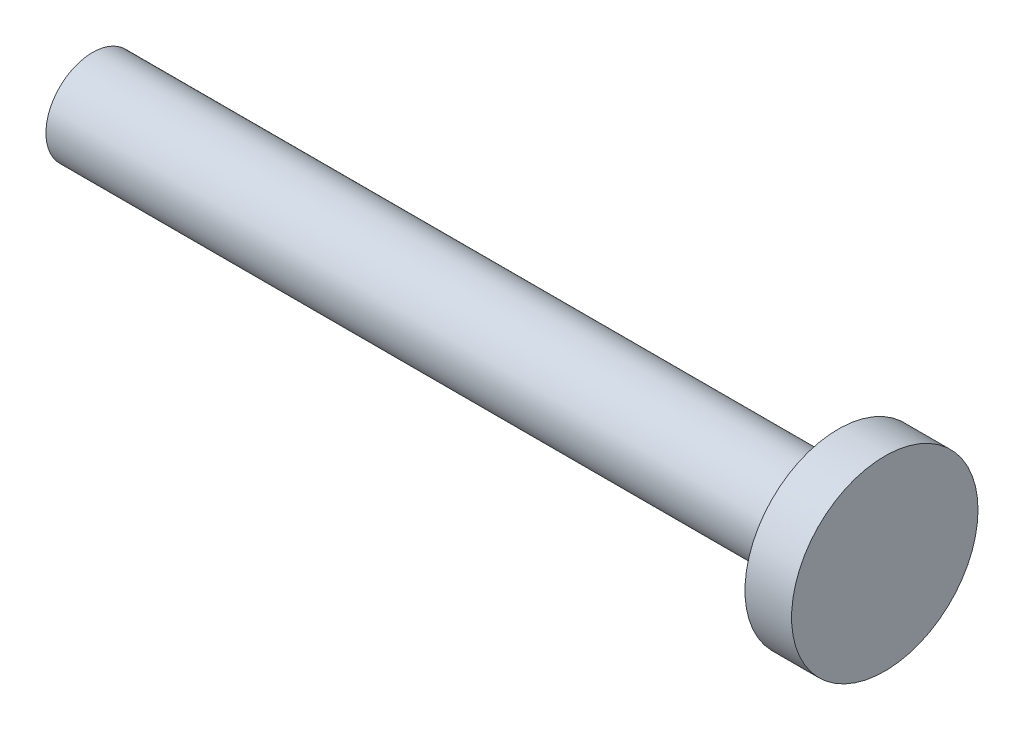
ISO-10303-21;
HEADER;
FILE_DESCRIPTION(('STEP AP214'),'2;1');
FILE_NAME('part.step','',(''),(''),'','','');
FILE_SCHEMA(('AUTOMOTIVE_DESIGN { 1 0 10303 214 1 1 1 1 }'));
ENDSEC;
DATA;
#1=APPLICATION_CONTEXT('core data for automotive mechanical design processes');
#2=APPLICATION_PROTOCOL_DEFINITION('international standard','automotive_design',2000,#1);
#3=PRODUCT_CONTEXT('',#1,'mechanical');
#4=PRODUCT('Part','Part','',(#3));
#5=PRODUCT_RELATED_PRODUCT_CATEGORY('part','',(#4));
#6=PRODUCT_DEFINITION_FORMATION('','',#4);
#7=PRODUCT_DEFINITION_CONTEXT('part definition',#1,'design');
#8=PRODUCT_DEFINITION('design','',#6,#7);
#9=PRODUCT_DEFINITION_SHAPE('','',#8);
#10=(LENGTH_UNIT() NAMED_UNIT(*) SI_UNIT(.MILLI.,.METRE.));
#11=(NAMED_UNIT(*) PLANE_ANGLE_UNIT() SI_UNIT($,.RADIAN.));
#12=(NAMED_UNIT(*) SI_UNIT($,.STERADIAN.) SOLID_ANGLE_UNIT());
#13=UNCERTAINTY_MEASURE_WITH_UNIT(LENGTH_MEASURE(1.E-05),#10,'distance_accuracy_value','');
#14=(GEOMETRIC_REPRESENTATION_CONTEXT(3) GLOBAL_UNCERTAINTY_ASSIGNED_CONTEXT((#13)) GLOBAL_UNIT_ASSIGNED_CONTEXT((#10,
#11,#12)) REPRESENTATION_CONTEXT('',''));
#15=CARTESIAN_POINT('',(0.,0.,0.));
#16=DIRECTION('',(0.,0.,1.));
#17=DIRECTION('',(1.,0.,0.));
#18=AXIS2_PLACEMENT_3D('',#15,#16,#17);
#19=CARTESIAN_POINT('',(-101.6,0.,0.));
#20=DIRECTION('',(1.,0.,0.));
#21=DIRECTION('',(0.,0.,-1.));
#22=AXIS2_PLACEMENT_3D('',#19,#20,#21);
#23=CYLINDRICAL_SURFACE('',#22,6.35);
#24=CARTESIAN_POINT('',(-101.6,0.,0.));
#25=DIRECTION('',(1.,0.,0.));
#26=DIRECTION('',(0.,0.,-1.));
#27=AXIS2_PLACEMENT_3D('',#24,#25,#26);
#28=CIRCLE('',#27,6.35);
#29=CARTESIAN_POINT('',(-101.6,0.,-6.35));
#30=VERTEX_POINT('',#29);
#31=EDGE_CURVE('E10',#30,#30,#28,.T.);
#32=ORIENTED_EDGE('',*,*,#31,.T.);
#33=EDGE_LOOP('',(#32));
#34=FACE_BOUND('',#33,.T.);
#35=CARTESIAN_POINT('',(0.,0.,0.));
#36=DIRECTION('',(1.,0.,0.));
#37=DIRECTION('',(0.,0.,-1.));
#38=AXIS2_PLACEMENT_3D('',#35,#36,#37);
#39=CIRCLE('',#38,6.35);
#40=CARTESIAN_POINT('',(0.,0.,-6.35));
#41=VERTEX_POINT('',#40);
#42=EDGE_CURVE('E34',#41,#41,#39,.T.);
#43=ORIENTED_EDGE('',*,*,#42,.F.);
#44=EDGE_LOOP('',(#43));
#45=FACE_BOUND('',#44,.T.);
#46=ADVANCED_FACE('F31',(#34,#45),#23,.T.);
#47=CARTESIAN_POINT('',(-101.6,0.,0.));
#48=DIRECTION('',(1.,0.,0.));
#49=DIRECTION('',(0.,0.,-1.));
#50=AXIS2_PLACEMENT_3D('',#47,#48,#49);
#51=PLANE('',#50);
#52=ORIENTED_EDGE('',*,*,#31,.F.);
#53=EDGE_LOOP('',(#52));
#54=FACE_BOUND('',#53,.T.);
#55=ADVANCED_FACE('F54',(#54),#51,.F.);
#56=CARTESIAN_POINT('',(6.35,0.,0.));
#57=DIRECTION('',(-1.,0.,0.));
#58=DIRECTION('',(0.,0.,1.));
#59=AXIS2_PLACEMENT_3D('',#56,#57,#58);
#60=CYLINDRICAL_SURFACE('',#59,12.7);
#61=CARTESIAN_POINT('',(6.35,0.,0.));
#62=DIRECTION('',(1.,0.,0.));
#63=DIRECTION('',(0.,0.,-1.));
#64=AXIS2_PLACEMENT_3D('',#61,#62,#63);
#65=CIRCLE('',#64,12.7);
#66=CARTESIAN_POINT('',(6.35,0.,-12.7));
#67=VERTEX_POINT('',#66);
#68=EDGE_CURVE('E41',#67,#67,#65,.T.);
#69=ORIENTED_EDGE('',*,*,#68,.F.);
#70=EDGE_LOOP('',(#69));
#71=FACE_BOUND('',#70,.T.);
#72=CARTESIAN_POINT('',(0.,0.,0.));
#73=DIRECTION('',(1.,0.,0.));
#74=DIRECTION('',(0.,0.,-1.));
#75=AXIS2_PLACEMENT_3D('',#72,#73,#74);
#76=CIRCLE('',#75,12.7);
#77=CARTESIAN_POINT('',(0.,0.,-12.7));
#78=VERTEX_POINT('',#77);
#79=EDGE_CURVE('E43',#78,#78,#76,.T.);
#80=ORIENTED_EDGE('',*,*,#79,.T.);
#81=EDGE_LOOP('',(#80));
#82=FACE_BOUND('',#81,.T.);
#83=ADVANCED_FACE('F51',(#71,#82),#60,.T.);
#84=CARTESIAN_POINT('',(6.35,0.,0.));
#85=DIRECTION('',(1.,0.,0.));
#86=DIRECTION('',(0.,0.,-1.));
#87=AXIS2_PLACEMENT_3D('',#84,#85,#86);
#88=PLANE('',#87);
#89=ORIENTED_EDGE('',*,*,#68,.T.);
#90=EDGE_LOOP('',(#89));
#91=FACE_BOUND('',#90,.T.);
#92=ADVANCED_FACE('F49',(#91),#88,.T.);
#93=CARTESIAN_POINT('',(0.,0.,0.));
#94=DIRECTION('',(1.,0.,0.));
#95=DIRECTION('',(0.,0.,-1.));
#96=AXIS2_PLACEMENT_3D('',#93,#94,#95);
#97=PLANE('',#96);
#98=ORIENTED_EDGE('',*,*,#42,.T.);
#99=EDGE_LOOP('',(#98));
#100=FACE_BOUND('',#99,.T.);
#101=ORIENTED_EDGE('',*,*,#79,.F.);
#102=EDGE_LOOP('',(#101));
#103=FACE_BOUND('',#102,.T.);
#104=ADVANCED_FACE('F58',(#100,#103),#97,.F.);
#105=CLOSED_SHELL('',(#46,#55,#83,#92,#104));
#106=MANIFOLD_SOLID_BREP('B2',#105);
#107=ADVANCED_BREP_SHAPE_REPRESENTATION('',(#18,#106),#14);
#108=SHAPE_DEFINITION_REPRESENTATION(#9,#107);
ENDSEC;
END-ISO-10303-21;
